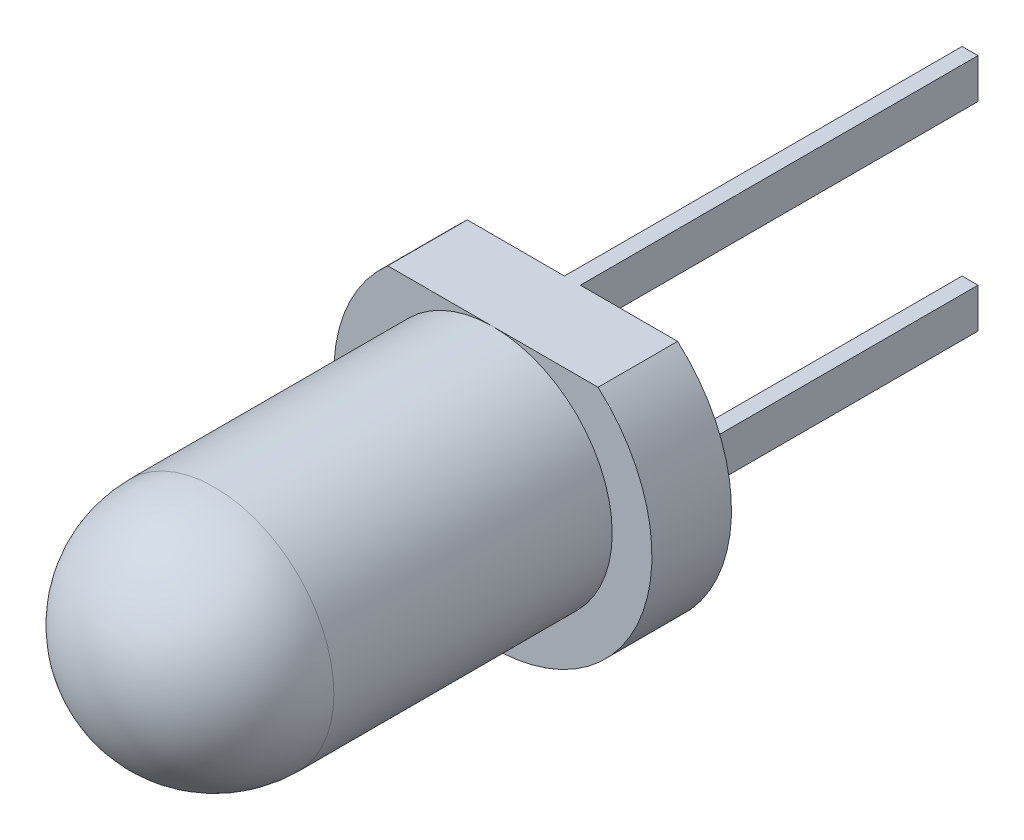
ISO-10303-21;
HEADER;
FILE_DESCRIPTION(('STEP AP214'),'2;1');
FILE_NAME('part.step','',(''),(''),'','','');
FILE_SCHEMA(('AUTOMOTIVE_DESIGN { 1 0 10303 214 1 1 1 1 }'));
ENDSEC;
DATA;
#1=APPLICATION_CONTEXT('core data for automotive mechanical design processes');
#2=APPLICATION_PROTOCOL_DEFINITION('international standard','automotive_design',2000,#1);
#3=PRODUCT_CONTEXT('',#1,'mechanical');
#4=PRODUCT('Part','Part','',(#3));
#5=PRODUCT_RELATED_PRODUCT_CATEGORY('part','',(#4));
#6=PRODUCT_DEFINITION_FORMATION('','',#4);
#7=PRODUCT_DEFINITION_CONTEXT('part definition',#1,'design');
#8=PRODUCT_DEFINITION('design','',#6,#7);
#9=PRODUCT_DEFINITION_SHAPE('','',#8);
#10=(LENGTH_UNIT() NAMED_UNIT(*) SI_UNIT(.MILLI.,.METRE.));
#11=(NAMED_UNIT(*) PLANE_ANGLE_UNIT() SI_UNIT($,.RADIAN.));
#12=(NAMED_UNIT(*) SI_UNIT($,.STERADIAN.) SOLID_ANGLE_UNIT());
#13=UNCERTAINTY_MEASURE_WITH_UNIT(LENGTH_MEASURE(1.E-05),#10,'distance_accuracy_value','');
#14=(GEOMETRIC_REPRESENTATION_CONTEXT(3) GLOBAL_UNCERTAINTY_ASSIGNED_CONTEXT((#13)) GLOBAL_UNIT_ASSIGNED_CONTEXT((#10,
#11,#12)) REPRESENTATION_CONTEXT('',''));
#15=CARTESIAN_POINT('',(0.,0.,0.));
#16=DIRECTION('',(0.,0.,1.));
#17=DIRECTION('',(1.,0.,0.));
#18=AXIS2_PLACEMENT_3D('',#15,#16,#17);
#19=CARTESIAN_POINT('',(0.,0.,-1.));
#20=DIRECTION('',(0.,0.,-1.));
#21=DIRECTION('',(-1.,0.,0.));
#22=AXIS2_PLACEMENT_3D('',#19,#20,#21);
#23=PLANE('',#22);
#24=DIRECTION('',(0.,1.,0.));
#25=VECTOR('',#24,1.);
#26=CARTESIAN_POINT('',(-0.0999999999999994,-1.5,-1.));
#27=LINE('',#26,#25);
#28=CARTESIAN_POINT('',(-0.0999999999999994,-1.5,-1.));
#29=VERTEX_POINT('',#28);
#30=CARTESIAN_POINT('',(-0.0999999999999994,-1.,-1.));
#31=VERTEX_POINT('',#30);
#32=EDGE_CURVE('E180',#29,#31,#27,.T.);
#33=ORIENTED_EDGE('',*,*,#32,.F.);
#34=DIRECTION('',(-1.,0.,0.));
#35=VECTOR('',#34,1.);
#36=CARTESIAN_POINT('',(0.1,-1.5,-1.));
#37=LINE('',#36,#35);
#38=CARTESIAN_POINT('',(0.1,-1.5,-1.));
#39=VERTEX_POINT('',#38);
#40=EDGE_CURVE('E182',#39,#29,#37,.T.);
#41=ORIENTED_EDGE('',*,*,#40,.F.);
#42=DIRECTION('',(0.,-1.,0.));
#43=VECTOR('',#42,1.);
#44=CARTESIAN_POINT('',(0.1,-1.5,-1.));
#45=LINE('',#44,#43);
#46=CARTESIAN_POINT('',(0.1,-1.,-1.));
#47=VERTEX_POINT('',#46);
#48=EDGE_CURVE('E175',#47,#39,#45,.T.);
#49=ORIENTED_EDGE('',*,*,#48,.F.);
#50=DIRECTION('',(1.,0.,0.));
#51=VECTOR('',#50,1.);
#52=CARTESIAN_POINT('',(0.1,-1.,-1.));
#53=LINE('',#52,#51);
#54=EDGE_CURVE('E178',#31,#47,#53,.T.);
#55=ORIENTED_EDGE('',*,*,#54,.F.);
#56=EDGE_LOOP('',(#33,#41,#49,#55));
#57=FACE_BOUND('',#56,.T.);
#58=CARTESIAN_POINT('',(0.,0.,-1.));
#59=DIRECTION('',(0.,0.,-1.));
#60=DIRECTION('',(-1.,0.,0.));
#61=AXIS2_PLACEMENT_3D('',#58,#59,#60);
#62=CIRCLE('',#61,2.);
#63=CARTESIAN_POINT('',(1.3228756555323,1.5,-1.));
#64=VERTEX_POINT('',#63);
#65=CARTESIAN_POINT('',(-1.3228756555323,1.5,-1.));
#66=VERTEX_POINT('',#65);
#67=EDGE_CURVE('E131',#64,#66,#62,.T.);
#68=ORIENTED_EDGE('',*,*,#67,.T.);
#69=DIRECTION('',(1.,0.,0.));
#70=VECTOR('',#69,1.);
#71=CARTESIAN_POINT('',(0.,1.5,-1.));
#72=LINE('',#71,#70);
#73=CARTESIAN_POINT('',(-0.0999999999999998,1.5,-1.));
#74=VERTEX_POINT('',#73);
#75=EDGE_CURVE('E136',#66,#74,#72,.T.);
#76=ORIENTED_EDGE('',*,*,#75,.T.);
#77=DIRECTION('',(0.,1.,0.));
#78=VECTOR('',#77,1.);
#79=CARTESIAN_POINT('',(-0.0999999999999998,1.5,-1.));
#80=LINE('',#79,#78);
#81=CARTESIAN_POINT('',(-0.0999999999999999,1.,-1.));
#82=VERTEX_POINT('',#81);
#83=EDGE_CURVE('E153',#82,#74,#80,.T.);
#84=ORIENTED_EDGE('',*,*,#83,.F.);
#85=DIRECTION('',(-1.,0.,0.));
#86=VECTOR('',#85,1.);
#87=CARTESIAN_POINT('',(0.1,1.,-1.));
#88=LINE('',#87,#86);
#89=CARTESIAN_POINT('',(0.1,1.,-1.));
#90=VERTEX_POINT('',#89);
#91=EDGE_CURVE('E157',#90,#82,#88,.T.);
#92=ORIENTED_EDGE('',*,*,#91,.F.);
#93=DIRECTION('',(0.,-1.,0.));
#94=VECTOR('',#93,1.);
#95=CARTESIAN_POINT('',(0.1,1.5,-1.));
#96=LINE('',#95,#94);
#97=CARTESIAN_POINT('',(0.1,1.5,-1.));
#98=VERTEX_POINT('',#97);
#99=EDGE_CURVE('E134',#98,#90,#96,.T.);
#100=ORIENTED_EDGE('',*,*,#99,.F.);
#101=EDGE_CURVE('E72',#98,#64,#72,.T.);
#102=ORIENTED_EDGE('',*,*,#101,.T.);
#103=EDGE_LOOP('',(#68,#76,#84,#92,#100,#102));
#104=FACE_BOUND('',#103,.T.);
#105=ADVANCED_FACE('F30',(#57,#104),#23,.T.);
#106=CARTESIAN_POINT('',(0.,0.,0.));
#107=DIRECTION('',(0.,0.,-1.));
#108=DIRECTION('',(-1.,0.,0.));
#109=AXIS2_PLACEMENT_3D('',#106,#107,#108);
#110=PLANE('',#109);
#111=DIRECTION('',(1.,0.,0.));
#112=VECTOR('',#111,1.);
#113=CARTESIAN_POINT('',(0.,1.5,0.));
#114=LINE('',#113,#112);
#115=CARTESIAN_POINT('',(-1.3228756555323,1.5,0.));
#116=VERTEX_POINT('',#115);
#117=CARTESIAN_POINT('',(0.,1.5,0.));
#118=VERTEX_POINT('',#117);
#119=EDGE_CURVE('E192',#116,#118,#114,.T.);
#120=ORIENTED_EDGE('',*,*,#119,.F.);
#121=CARTESIAN_POINT('',(0.,0.,0.));
#122=DIRECTION('',(0.,0.,-1.));
#123=DIRECTION('',(-1.,0.,0.));
#124=AXIS2_PLACEMENT_3D('',#121,#122,#123);
#125=CIRCLE('',#124,2.);
#126=CARTESIAN_POINT('',(1.3228756555323,1.5,0.));
#127=VERTEX_POINT('',#126);
#128=EDGE_CURVE('E139',#127,#116,#125,.T.);
#129=ORIENTED_EDGE('',*,*,#128,.F.);
#130=EDGE_CURVE('E121',#118,#127,#114,.T.);
#131=ORIENTED_EDGE('',*,*,#130,.F.);
#132=CARTESIAN_POINT('',(0.,0.,0.));
#133=DIRECTION('',(0.,0.,-1.));
#134=DIRECTION('',(-1.,0.,0.));
#135=AXIS2_PLACEMENT_3D('',#132,#133,#134);
#136=CIRCLE('',#135,1.5);
#137=EDGE_CURVE('E38',#118,#118,#136,.T.);
#138=ORIENTED_EDGE('',*,*,#137,.T.);
#139=EDGE_LOOP('',(#120,#129,#131,#138));
#140=FACE_BOUND('',#139,.T.);
#141=ADVANCED_FACE('F196',(#140),#110,.F.);
#142=CARTESIAN_POINT('',(0.,0.,-1.));
#143=DIRECTION('',(0.,0.,1.));
#144=DIRECTION('',(1.,0.,0.));
#145=AXIS2_PLACEMENT_3D('',#142,#143,#144);
#146=CYLINDRICAL_SURFACE('',#145,2.);
#147=DIRECTION('',(0.,0.,1.));
#148=VECTOR('',#147,1.);
#149=CARTESIAN_POINT('',(-1.3228756555323,1.5,-16.4616460960662));
#150=LINE('',#149,#148);
#151=EDGE_CURVE('E126',#66,#116,#150,.T.);
#152=ORIENTED_EDGE('',*,*,#151,.F.);
#153=ORIENTED_EDGE('',*,*,#67,.F.);
#154=DIRECTION('',(0.,0.,1.));
#155=VECTOR('',#154,1.);
#156=CARTESIAN_POINT('',(1.3228756555323,1.5,-16.4616460960662));
#157=LINE('',#156,#155);
#158=EDGE_CURVE('E117',#64,#127,#157,.T.);
#159=ORIENTED_EDGE('',*,*,#158,.T.);
#160=ORIENTED_EDGE('',*,*,#128,.T.);
#161=EDGE_LOOP('',(#152,#153,#159,#160));
#162=FACE_BOUND('',#161,.T.);
#163=ADVANCED_FACE('F138',(#162),#146,.T.);
#164=CARTESIAN_POINT('',(0.,0.,3.5));
#165=DIRECTION('',(0.,0.,-1.));
#166=DIRECTION('',(-1.,0.,0.));
#167=AXIS2_PLACEMENT_3D('',#164,#165,#166);
#168=CYLINDRICAL_SURFACE('',#167,1.5);
#169=ORIENTED_EDGE('',*,*,#137,.F.);
#170=EDGE_LOOP('',(#169));
#171=FACE_BOUND('',#170,.T.);
#172=CARTESIAN_POINT('',(0.,0.,3.5));
#173=DIRECTION('',(0.,0.,1.));
#174=DIRECTION('',(1.,0.,0.));
#175=AXIS2_PLACEMENT_3D('',#172,#173,#174);
#176=CIRCLE('',#175,1.5);
#177=CARTESIAN_POINT('',(1.5,0.,3.5));
#178=VERTEX_POINT('',#177);
#179=EDGE_CURVE('E11',#178,#178,#176,.T.);
#180=ORIENTED_EDGE('',*,*,#179,.F.);
#181=EDGE_LOOP('',(#180));
#182=FACE_BOUND('',#181,.T.);
#183=ADVANCED_FACE('F232',(#171,#182),#168,.T.);
#184=CARTESIAN_POINT('',(0.,0.,3.5));
#185=DIRECTION('',(0.,0.,1.));
#186=DIRECTION('',(1.,0.,0.));
#187=AXIS2_PLACEMENT_3D('',#184,#185,#186);
#188=SPHERICAL_SURFACE('',#187,1.5);
#189=ORIENTED_EDGE('',*,*,#179,.T.);
#190=EDGE_LOOP('',(#189));
#191=FACE_BOUND('',#190,.T.);
#192=ADVANCED_FACE('F32',(#191),#188,.T.);
#193=CARTESIAN_POINT('',(0.1,1.5,-6.));
#194=DIRECTION('',(-1.,0.,0.));
#195=DIRECTION('',(0.,-1.,0.));
#196=AXIS2_PLACEMENT_3D('',#193,#194,#195);
#197=PLANE('',#196);
#198=ORIENTED_EDGE('',*,*,#99,.T.);
#199=DIRECTION('',(0.,0.,1.));
#200=VECTOR('',#199,1.);
#201=CARTESIAN_POINT('',(0.1,1.,-6.));
#202=LINE('',#201,#200);
#203=CARTESIAN_POINT('',(0.1,1.,-6.));
#204=VERTEX_POINT('',#203);
#205=EDGE_CURVE('E142',#204,#90,#202,.T.);
#206=ORIENTED_EDGE('',*,*,#205,.F.);
#207=DIRECTION('',(0.,-1.,0.));
#208=VECTOR('',#207,1.);
#209=CARTESIAN_POINT('',(0.1,1.5,-6.));
#210=LINE('',#209,#208);
#211=CARTESIAN_POINT('',(0.1,1.5,-6.));
#212=VERTEX_POINT('',#211);
#213=EDGE_CURVE('E156',#212,#204,#210,.T.);
#214=ORIENTED_EDGE('',*,*,#213,.F.);
#215=DIRECTION('',(0.,0.,1.));
#216=VECTOR('',#215,1.);
#217=CARTESIAN_POINT('',(0.1,1.5,-6.));
#218=LINE('',#217,#216);
#219=EDGE_CURVE('E151',#212,#98,#218,.T.);
#220=ORIENTED_EDGE('',*,*,#219,.T.);
#221=EDGE_LOOP('',(#198,#206,#214,#220));
#222=FACE_BOUND('',#221,.T.);
#223=ADVANCED_FACE('F207',(#222),#197,.F.);
#224=CARTESIAN_POINT('',(0.1,1.,-6.));
#225=DIRECTION('',(0.,1.,0.));
#226=DIRECTION('',(0.,0.,1.));
#227=AXIS2_PLACEMENT_3D('',#224,#225,#226);
#228=PLANE('',#227);
#229=ORIENTED_EDGE('',*,*,#91,.T.);
#230=DIRECTION('',(0.,0.,1.));
#231=VECTOR('',#230,1.);
#232=CARTESIAN_POINT('',(-0.0999999999999999,1.,-6.));
#233=LINE('',#232,#231);
#234=CARTESIAN_POINT('',(-0.0999999999999999,1.,-6.));
#235=VERTEX_POINT('',#234);
#236=EDGE_CURVE('E146',#235,#82,#233,.T.);
#237=ORIENTED_EDGE('',*,*,#236,.F.);
#238=DIRECTION('',(-1.,0.,0.));
#239=VECTOR('',#238,1.);
#240=CARTESIAN_POINT('',(0.1,1.,-6.));
#241=LINE('',#240,#239);
#242=EDGE_CURVE('E79',#204,#235,#241,.T.);
#243=ORIENTED_EDGE('',*,*,#242,.F.);
#244=ORIENTED_EDGE('',*,*,#205,.T.);
#245=EDGE_LOOP('',(#229,#237,#243,#244));
#246=FACE_BOUND('',#245,.T.);
#247=ADVANCED_FACE('F203',(#246),#228,.F.);
#248=CARTESIAN_POINT('',(-0.0999999999999998,1.5,-6.));
#249=DIRECTION('',(1.,0.,0.));
#250=DIRECTION('',(0.,1.,0.));
#251=AXIS2_PLACEMENT_3D('',#248,#249,#250);
#252=PLANE('',#251);
#253=ORIENTED_EDGE('',*,*,#83,.T.);
#254=DIRECTION('',(0.,0.,1.));
#255=VECTOR('',#254,1.);
#256=CARTESIAN_POINT('',(-0.0999999999999998,1.5,-6.));
#257=LINE('',#256,#255);
#258=CARTESIAN_POINT('',(-0.0999999999999998,1.5,-6.));
#259=VERTEX_POINT('',#258);
#260=EDGE_CURVE('E149',#259,#74,#257,.T.);
#261=ORIENTED_EDGE('',*,*,#260,.F.);
#262=DIRECTION('',(0.,1.,0.));
#263=VECTOR('',#262,1.);
#264=CARTESIAN_POINT('',(-0.0999999999999998,1.5,-6.));
#265=LINE('',#264,#263);
#266=EDGE_CURVE('E162',#235,#259,#265,.T.);
#267=ORIENTED_EDGE('',*,*,#266,.F.);
#268=ORIENTED_EDGE('',*,*,#236,.T.);
#269=EDGE_LOOP('',(#253,#261,#267,#268));
#270=FACE_BOUND('',#269,.T.);
#271=ADVANCED_FACE('F202',(#270),#252,.F.);
#272=CARTESIAN_POINT('',(0.1,1.5,-6.));
#273=DIRECTION('',(0.,-1.,0.));
#274=DIRECTION('',(0.,0.,-1.));
#275=AXIS2_PLACEMENT_3D('',#272,#273,#274);
#276=PLANE('',#275);
#277=ORIENTED_EDGE('',*,*,#260,.T.);
#278=ORIENTED_EDGE('',*,*,#75,.F.);
#279=ORIENTED_EDGE('',*,*,#151,.T.);
#280=ORIENTED_EDGE('',*,*,#119,.T.);
#281=ORIENTED_EDGE('',*,*,#130,.T.);
#282=ORIENTED_EDGE('',*,*,#158,.F.);
#283=ORIENTED_EDGE('',*,*,#101,.F.);
#284=ORIENTED_EDGE('',*,*,#219,.F.);
#285=DIRECTION('',(1.,0.,0.));
#286=VECTOR('',#285,1.);
#287=CARTESIAN_POINT('',(0.1,1.5,-6.));
#288=LINE('',#287,#286);
#289=EDGE_CURVE('E54',#259,#212,#288,.T.);
#290=ORIENTED_EDGE('',*,*,#289,.F.);
#291=EDGE_LOOP('',(#277,#278,#279,#280,#281,#282,#283,#284,#290));
#292=FACE_BOUND('',#291,.T.);
#293=ADVANCED_FACE('F119',(#292),#276,.F.);
#294=CARTESIAN_POINT('',(0.1,1.,-6.));
#295=DIRECTION('',(0.,0.,-1.));
#296=DIRECTION('',(-1.,0.,0.));
#297=AXIS2_PLACEMENT_3D('',#294,#295,#296);
#298=PLANE('',#297);
#299=ORIENTED_EDGE('',*,*,#213,.T.);
#300=ORIENTED_EDGE('',*,*,#242,.T.);
#301=ORIENTED_EDGE('',*,*,#266,.T.);
#302=ORIENTED_EDGE('',*,*,#289,.T.);
#303=EDGE_LOOP('',(#299,#300,#301,#302));
#304=FACE_BOUND('',#303,.T.);
#305=ADVANCED_FACE('F208',(#304),#298,.T.);
#306=CARTESIAN_POINT('',(0.1,-1.5,-6.));
#307=DIRECTION('',(0.,1.,0.));
#308=DIRECTION('',(0.,0.,1.));
#309=AXIS2_PLACEMENT_3D('',#306,#307,#308);
#310=PLANE('',#309);
#311=ORIENTED_EDGE('',*,*,#40,.T.);
#312=DIRECTION('',(0.,0.,1.));
#313=VECTOR('',#312,1.);
#314=CARTESIAN_POINT('',(-0.0999999999999994,-1.5,-6.));
#315=LINE('',#314,#313);
#316=CARTESIAN_POINT('',(-0.0999999999999994,-1.5,-6.));
#317=VERTEX_POINT('',#316);
#318=EDGE_CURVE('E160',#317,#29,#315,.T.);
#319=ORIENTED_EDGE('',*,*,#318,.F.);
#320=DIRECTION('',(-1.,0.,0.));
#321=VECTOR('',#320,1.);
#322=CARTESIAN_POINT('',(0.1,-1.5,-6.));
#323=LINE('',#322,#321);
#324=CARTESIAN_POINT('',(0.1,-1.5,-6.));
#325=VERTEX_POINT('',#324);
#326=EDGE_CURVE('E177',#325,#317,#323,.T.);
#327=ORIENTED_EDGE('',*,*,#326,.F.);
#328=DIRECTION('',(0.,0.,1.));
#329=VECTOR('',#328,1.);
#330=CARTESIAN_POINT('',(0.1,-1.5,-6.));
#331=LINE('',#330,#329);
#332=EDGE_CURVE('E171',#325,#39,#331,.T.);
#333=ORIENTED_EDGE('',*,*,#332,.T.);
#334=EDGE_LOOP('',(#311,#319,#327,#333));
#335=FACE_BOUND('',#334,.T.);
#336=ADVANCED_FACE('F210',(#335),#310,.F.);
#337=CARTESIAN_POINT('',(-0.0999999999999994,-1.5,-6.));
#338=DIRECTION('',(1.,0.,0.));
#339=DIRECTION('',(0.,1.,0.));
#340=AXIS2_PLACEMENT_3D('',#337,#338,#339);
#341=PLANE('',#340);
#342=ORIENTED_EDGE('',*,*,#32,.T.);
#343=DIRECTION('',(0.,0.,1.));
#344=VECTOR('',#343,1.);
#345=CARTESIAN_POINT('',(-0.0999999999999994,-1.,-6.));
#346=LINE('',#345,#344);
#347=CARTESIAN_POINT('',(-0.0999999999999994,-1.,-6.));
#348=VERTEX_POINT('',#347);
#349=EDGE_CURVE('E167',#348,#31,#346,.T.);
#350=ORIENTED_EDGE('',*,*,#349,.F.);
#351=DIRECTION('',(0.,1.,0.));
#352=VECTOR('',#351,1.);
#353=CARTESIAN_POINT('',(-0.0999999999999994,-1.5,-6.));
#354=LINE('',#353,#352);
#355=EDGE_CURVE('E188',#317,#348,#354,.T.);
#356=ORIENTED_EDGE('',*,*,#355,.F.);
#357=ORIENTED_EDGE('',*,*,#318,.T.);
#358=EDGE_LOOP('',(#342,#350,#356,#357));
#359=FACE_BOUND('',#358,.T.);
#360=ADVANCED_FACE('F216',(#359),#341,.F.);
#361=CARTESIAN_POINT('',(0.1,-1.,-6.));
#362=DIRECTION('',(0.,-1.,0.));
#363=DIRECTION('',(0.,0.,-1.));
#364=AXIS2_PLACEMENT_3D('',#361,#362,#363);
#365=PLANE('',#364);
#366=ORIENTED_EDGE('',*,*,#54,.T.);
#367=DIRECTION('',(0.,0.,1.));
#368=VECTOR('',#367,1.);
#369=CARTESIAN_POINT('',(0.1,-1.,-6.));
#370=LINE('',#369,#368);
#371=CARTESIAN_POINT('',(0.1,-1.,-6.));
#372=VERTEX_POINT('',#371);
#373=EDGE_CURVE('E45',#372,#47,#370,.T.);
#374=ORIENTED_EDGE('',*,*,#373,.F.);
#375=DIRECTION('',(1.,0.,0.));
#376=VECTOR('',#375,1.);
#377=CARTESIAN_POINT('',(0.1,-1.,-6.));
#378=LINE('',#377,#376);
#379=EDGE_CURVE('E186',#348,#372,#378,.T.);
#380=ORIENTED_EDGE('',*,*,#379,.F.);
#381=ORIENTED_EDGE('',*,*,#349,.T.);
#382=EDGE_LOOP('',(#366,#374,#380,#381));
#383=FACE_BOUND('',#382,.T.);
#384=ADVANCED_FACE('F295',(#383),#365,.F.);
#385=CARTESIAN_POINT('',(0.1,-1.5,-6.));
#386=DIRECTION('',(-1.,0.,0.));
#387=DIRECTION('',(0.,-1.,0.));
#388=AXIS2_PLACEMENT_3D('',#385,#386,#387);
#389=PLANE('',#388);
#390=ORIENTED_EDGE('',*,*,#48,.T.);
#391=ORIENTED_EDGE('',*,*,#332,.F.);
#392=DIRECTION('',(0.,-1.,0.));
#393=VECTOR('',#392,1.);
#394=CARTESIAN_POINT('',(0.1,-1.5,-6.));
#395=LINE('',#394,#393);
#396=EDGE_CURVE('E174',#372,#325,#395,.T.);
#397=ORIENTED_EDGE('',*,*,#396,.F.);
#398=ORIENTED_EDGE('',*,*,#373,.T.);
#399=EDGE_LOOP('',(#390,#391,#397,#398));
#400=FACE_BOUND('',#399,.T.);
#401=ADVANCED_FACE('F286',(#400),#389,.F.);
#402=CARTESIAN_POINT('',(-0.0999999999999994,-1.5,-6.));
#403=DIRECTION('',(0.,0.,-1.));
#404=DIRECTION('',(-1.,0.,0.));
#405=AXIS2_PLACEMENT_3D('',#402,#403,#404);
#406=PLANE('',#405);
#407=ORIENTED_EDGE('',*,*,#326,.T.);
#408=ORIENTED_EDGE('',*,*,#355,.T.);
#409=ORIENTED_EDGE('',*,*,#379,.T.);
#410=ORIENTED_EDGE('',*,*,#396,.T.);
#411=EDGE_LOOP('',(#407,#408,#409,#410));
#412=FACE_BOUND('',#411,.T.);
#413=ADVANCED_FACE('F281',(#412),#406,.T.);
#414=CLOSED_SHELL('',(#105,#141,#163,#183,#192,#223,#247,#271,#293,#305,#336,#360,#384,#401,#413));
#415=MANIFOLD_SOLID_BREP('B2',#414);
#416=ADVANCED_BREP_SHAPE_REPRESENTATION('',(#18,#415),#14);
#417=SHAPE_DEFINITION_REPRESENTATION(#9,#416);
ENDSEC;
END-ISO-10303-21;
